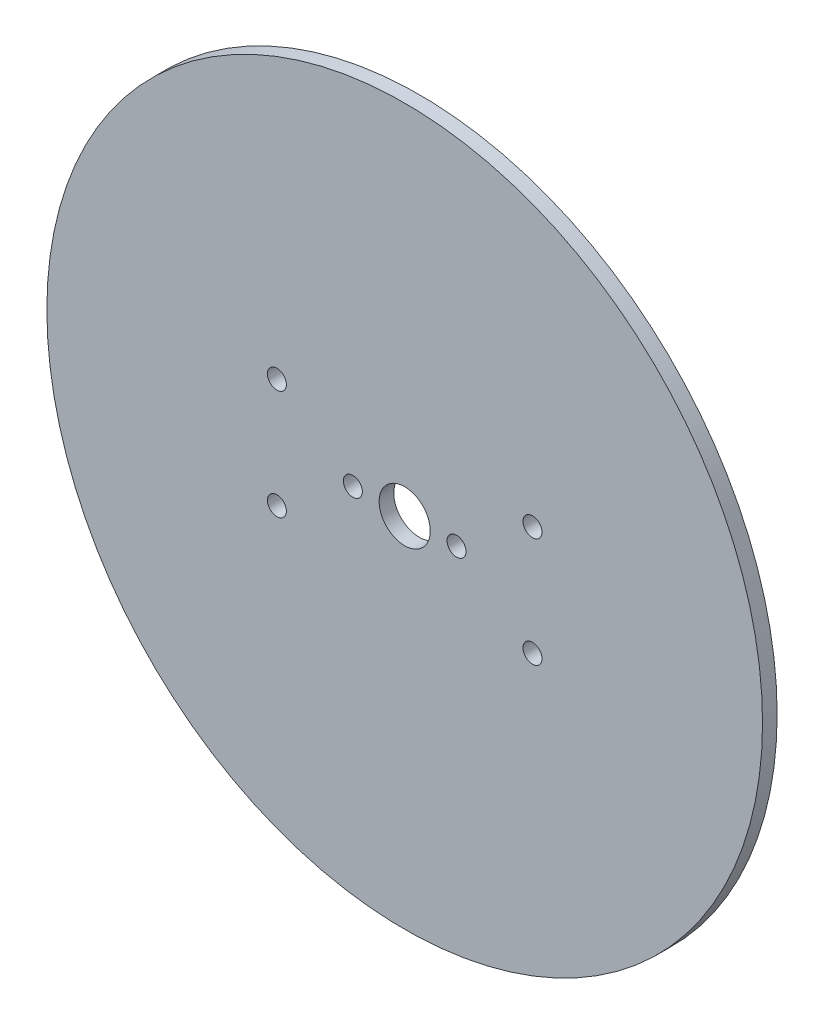
ISO-10303-21;
HEADER;
FILE_DESCRIPTION(('STEP AP214'),'2;1');
FILE_NAME('part.step','',(''),(''),'','','');
FILE_SCHEMA(('AUTOMOTIVE_DESIGN { 1 0 10303 214 1 1 1 1 }'));
ENDSEC;
DATA;
#1=APPLICATION_CONTEXT('core data for automotive mechanical design processes');
#2=APPLICATION_PROTOCOL_DEFINITION('international standard','automotive_design',2000,#1);
#3=PRODUCT_CONTEXT('',#1,'mechanical');
#4=PRODUCT('Part','Part','',(#3));
#5=PRODUCT_RELATED_PRODUCT_CATEGORY('part','',(#4));
#6=PRODUCT_DEFINITION_FORMATION('','',#4);
#7=PRODUCT_DEFINITION_CONTEXT('part definition',#1,'design');
#8=PRODUCT_DEFINITION('design','',#6,#7);
#9=PRODUCT_DEFINITION_SHAPE('','',#8);
#10=(LENGTH_UNIT() NAMED_UNIT(*) SI_UNIT(.MILLI.,.METRE.));
#11=(NAMED_UNIT(*) PLANE_ANGLE_UNIT() SI_UNIT($,.RADIAN.));
#12=(NAMED_UNIT(*) SI_UNIT($,.STERADIAN.) SOLID_ANGLE_UNIT());
#13=UNCERTAINTY_MEASURE_WITH_UNIT(LENGTH_MEASURE(1.E-05),#10,'distance_accuracy_value','');
#14=(GEOMETRIC_REPRESENTATION_CONTEXT(3) GLOBAL_UNCERTAINTY_ASSIGNED_CONTEXT((#13)) GLOBAL_UNIT_ASSIGNED_CONTEXT((#10,
#11,#12)) REPRESENTATION_CONTEXT('',''));
#15=CARTESIAN_POINT('',(0.,0.,0.));
#16=DIRECTION('',(0.,0.,1.));
#17=DIRECTION('',(1.,0.,0.));
#18=AXIS2_PLACEMENT_3D('',#15,#16,#17);
#19=CARTESIAN_POINT('',(0.,0.,2.));
#20=DIRECTION('',(0.,0.,-1.));
#21=DIRECTION('',(-1.,0.,0.));
#22=AXIS2_PLACEMENT_3D('',#19,#20,#21);
#23=CYLINDRICAL_SURFACE('',#22,49.);
#24=CARTESIAN_POINT('',(0.,0.,2.));
#25=DIRECTION('',(0.,0.,1.));
#26=DIRECTION('',(1.,0.,0.));
#27=AXIS2_PLACEMENT_3D('',#24,#25,#26);
#28=CIRCLE('',#27,49.);
#29=CARTESIAN_POINT('',(49.,0.,2.));
#30=VERTEX_POINT('',#29);
#31=EDGE_CURVE('E11',#30,#30,#28,.T.);
#32=ORIENTED_EDGE('',*,*,#31,.F.);
#33=EDGE_LOOP('',(#32));
#34=FACE_BOUND('',#33,.T.);
#35=CARTESIAN_POINT('',(0.,0.,0.));
#36=DIRECTION('',(0.,0.,1.));
#37=DIRECTION('',(1.,0.,0.));
#38=AXIS2_PLACEMENT_3D('',#35,#36,#37);
#39=CIRCLE('',#38,49.);
#40=CARTESIAN_POINT('',(49.,0.,0.));
#41=VERTEX_POINT('',#40);
#42=EDGE_CURVE('E49',#41,#41,#39,.T.);
#43=ORIENTED_EDGE('',*,*,#42,.T.);
#44=EDGE_LOOP('',(#43));
#45=FACE_BOUND('',#44,.T.);
#46=ADVANCED_FACE('F46',(#34,#45),#23,.T.);
#47=CARTESIAN_POINT('',(0.,0.,2.));
#48=DIRECTION('',(0.,0.,1.));
#49=DIRECTION('',(1.,0.,0.));
#50=AXIS2_PLACEMENT_3D('',#47,#48,#49);
#51=PLANE('',#50);
#52=CARTESIAN_POINT('',(-7.1,0.,2.));
#53=DIRECTION('',(0.,0.,1.));
#54=DIRECTION('',(1.,0.,0.));
#55=AXIS2_PLACEMENT_3D('',#52,#53,#54);
#56=CIRCLE('',#55,1.3);
#57=CARTESIAN_POINT('',(-5.8,0.,2.));
#58=VERTEX_POINT('',#57);
#59=EDGE_CURVE('E96',#58,#58,#56,.T.);
#60=ORIENTED_EDGE('',*,*,#59,.F.);
#61=EDGE_LOOP('',(#60));
#62=FACE_BOUND('',#61,.T.);
#63=CARTESIAN_POINT('',(7.1,0.,2.));
#64=DIRECTION('',(0.,0.,1.));
#65=DIRECTION('',(1.,0.,0.));
#66=AXIS2_PLACEMENT_3D('',#63,#64,#65);
#67=CIRCLE('',#66,1.3);
#68=CARTESIAN_POINT('',(8.4,0.,2.));
#69=VERTEX_POINT('',#68);
#70=EDGE_CURVE('E90',#69,#69,#67,.T.);
#71=ORIENTED_EDGE('',*,*,#70,.F.);
#72=EDGE_LOOP('',(#71));
#73=FACE_BOUND('',#72,.T.);
#74=CARTESIAN_POINT('',(-17.5,7.5,2.));
#75=DIRECTION('',(0.,0.,1.));
#76=DIRECTION('',(1.,0.,0.));
#77=AXIS2_PLACEMENT_3D('',#74,#75,#76);
#78=CIRCLE('',#77,1.3);
#79=CARTESIAN_POINT('',(-16.2,7.5,2.));
#80=VERTEX_POINT('',#79);
#81=EDGE_CURVE('E84',#80,#80,#78,.T.);
#82=ORIENTED_EDGE('',*,*,#81,.F.);
#83=EDGE_LOOP('',(#82));
#84=FACE_BOUND('',#83,.T.);
#85=CARTESIAN_POINT('',(-17.5,-7.5,2.));
#86=DIRECTION('',(0.,0.,1.));
#87=DIRECTION('',(1.,0.,0.));
#88=AXIS2_PLACEMENT_3D('',#85,#86,#87);
#89=CIRCLE('',#88,1.3);
#90=CARTESIAN_POINT('',(-16.2,-7.5,2.));
#91=VERTEX_POINT('',#90);
#92=EDGE_CURVE('E78',#91,#91,#89,.T.);
#93=ORIENTED_EDGE('',*,*,#92,.F.);
#94=EDGE_LOOP('',(#93));
#95=FACE_BOUND('',#94,.T.);
#96=CARTESIAN_POINT('',(17.5,-7.5,2.));
#97=DIRECTION('',(0.,0.,1.));
#98=DIRECTION('',(1.,0.,0.));
#99=AXIS2_PLACEMENT_3D('',#96,#97,#98);
#100=CIRCLE('',#99,1.3);
#101=CARTESIAN_POINT('',(18.8,-7.5,2.));
#102=VERTEX_POINT('',#101);
#103=EDGE_CURVE('E72',#102,#102,#100,.T.);
#104=ORIENTED_EDGE('',*,*,#103,.F.);
#105=EDGE_LOOP('',(#104));
#106=FACE_BOUND('',#105,.T.);
#107=CARTESIAN_POINT('',(17.5,7.5,2.));
#108=DIRECTION('',(0.,0.,1.));
#109=DIRECTION('',(1.,0.,0.));
#110=AXIS2_PLACEMENT_3D('',#107,#108,#109);
#111=CIRCLE('',#110,1.3);
#112=CARTESIAN_POINT('',(18.8,7.5,2.));
#113=VERTEX_POINT('',#112);
#114=EDGE_CURVE('E64',#113,#113,#111,.T.);
#115=ORIENTED_EDGE('',*,*,#114,.F.);
#116=EDGE_LOOP('',(#115));
#117=FACE_BOUND('',#116,.T.);
#118=CARTESIAN_POINT('',(0.,0.,2.));
#119=DIRECTION('',(0.,0.,1.));
#120=DIRECTION('',(1.,0.,0.));
#121=AXIS2_PLACEMENT_3D('',#118,#119,#120);
#122=CIRCLE('',#121,3.5);
#123=CARTESIAN_POINT('',(3.5,0.,2.));
#124=VERTEX_POINT('',#123);
#125=EDGE_CURVE('E61',#124,#124,#122,.F.);
#126=ORIENTED_EDGE('',*,*,#125,.T.);
#127=EDGE_LOOP('',(#126));
#128=FACE_BOUND('',#127,.T.);
#129=ORIENTED_EDGE('',*,*,#31,.T.);
#130=EDGE_LOOP('',(#129));
#131=FACE_BOUND('',#130,.T.);
#132=ADVANCED_FACE('F110',(#62,#73,#84,#95,#106,#117,#128,#131),#51,.T.);
#133=CARTESIAN_POINT('',(0.,0.,0.));
#134=DIRECTION('',(0.,0.,1.));
#135=DIRECTION('',(1.,0.,0.));
#136=AXIS2_PLACEMENT_3D('',#133,#134,#135);
#137=PLANE('',#136);
#138=CARTESIAN_POINT('',(-7.1,0.,0.));
#139=DIRECTION('',(0.,0.,-1.));
#140=DIRECTION('',(-1.,0.,0.));
#141=AXIS2_PLACEMENT_3D('',#138,#139,#140);
#142=CIRCLE('',#141,1.3);
#143=CARTESIAN_POINT('',(-8.4,0.,0.));
#144=VERTEX_POINT('',#143);
#145=EDGE_CURVE('E99',#144,#144,#142,.T.);
#146=ORIENTED_EDGE('',*,*,#145,.F.);
#147=EDGE_LOOP('',(#146));
#148=FACE_BOUND('',#147,.T.);
#149=CARTESIAN_POINT('',(7.1,0.,0.));
#150=DIRECTION('',(0.,0.,-1.));
#151=DIRECTION('',(-1.,0.,0.));
#152=AXIS2_PLACEMENT_3D('',#149,#150,#151);
#153=CIRCLE('',#152,1.3);
#154=CARTESIAN_POINT('',(5.8,0.,0.));
#155=VERTEX_POINT('',#154);
#156=EDGE_CURVE('E93',#155,#155,#153,.T.);
#157=ORIENTED_EDGE('',*,*,#156,.F.);
#158=EDGE_LOOP('',(#157));
#159=FACE_BOUND('',#158,.T.);
#160=CARTESIAN_POINT('',(-17.5,7.5,0.));
#161=DIRECTION('',(0.,0.,-1.));
#162=DIRECTION('',(-1.,0.,0.));
#163=AXIS2_PLACEMENT_3D('',#160,#161,#162);
#164=CIRCLE('',#163,1.3);
#165=CARTESIAN_POINT('',(-18.8,7.5,0.));
#166=VERTEX_POINT('',#165);
#167=EDGE_CURVE('E87',#166,#166,#164,.T.);
#168=ORIENTED_EDGE('',*,*,#167,.F.);
#169=EDGE_LOOP('',(#168));
#170=FACE_BOUND('',#169,.T.);
#171=CARTESIAN_POINT('',(-17.5,-7.5,0.));
#172=DIRECTION('',(0.,0.,-1.));
#173=DIRECTION('',(-1.,0.,0.));
#174=AXIS2_PLACEMENT_3D('',#171,#172,#173);
#175=CIRCLE('',#174,1.3);
#176=CARTESIAN_POINT('',(-18.8,-7.5,0.));
#177=VERTEX_POINT('',#176);
#178=EDGE_CURVE('E81',#177,#177,#175,.T.);
#179=ORIENTED_EDGE('',*,*,#178,.F.);
#180=EDGE_LOOP('',(#179));
#181=FACE_BOUND('',#180,.T.);
#182=CARTESIAN_POINT('',(17.5,-7.5,0.));
#183=DIRECTION('',(0.,0.,-1.));
#184=DIRECTION('',(-1.,0.,0.));
#185=AXIS2_PLACEMENT_3D('',#182,#183,#184);
#186=CIRCLE('',#185,1.3);
#187=CARTESIAN_POINT('',(16.2,-7.5,0.));
#188=VERTEX_POINT('',#187);
#189=EDGE_CURVE('E75',#188,#188,#186,.T.);
#190=ORIENTED_EDGE('',*,*,#189,.F.);
#191=EDGE_LOOP('',(#190));
#192=FACE_BOUND('',#191,.T.);
#193=CARTESIAN_POINT('',(17.5,7.5,0.));
#194=DIRECTION('',(0.,0.,-1.));
#195=DIRECTION('',(-1.,0.,0.));
#196=AXIS2_PLACEMENT_3D('',#193,#194,#195);
#197=CIRCLE('',#196,1.3);
#198=CARTESIAN_POINT('',(16.2,7.5,0.));
#199=VERTEX_POINT('',#198);
#200=EDGE_CURVE('E69',#199,#199,#197,.T.);
#201=ORIENTED_EDGE('',*,*,#200,.F.);
#202=EDGE_LOOP('',(#201));
#203=FACE_BOUND('',#202,.T.);
#204=CARTESIAN_POINT('',(0.,0.,0.));
#205=DIRECTION('',(0.,0.,-1.));
#206=DIRECTION('',(-1.,0.,0.));
#207=AXIS2_PLACEMENT_3D('',#204,#205,#206);
#208=CIRCLE('',#207,3.5);
#209=CARTESIAN_POINT('',(-3.5,0.,0.));
#210=VERTEX_POINT('',#209);
#211=EDGE_CURVE('E58',#210,#210,#208,.T.);
#212=ORIENTED_EDGE('',*,*,#211,.F.);
#213=EDGE_LOOP('',(#212));
#214=FACE_BOUND('',#213,.T.);
#215=ORIENTED_EDGE('',*,*,#42,.F.);
#216=EDGE_LOOP('',(#215));
#217=FACE_BOUND('',#216,.T.);
#218=ADVANCED_FACE('F106',(#148,#159,#170,#181,#192,#203,#214,#217),#137,.F.);
#219=CARTESIAN_POINT('',(0.,0.,2.001));
#220=DIRECTION('',(0.,0.,-1.));
#221=DIRECTION('',(-1.,0.,0.));
#222=AXIS2_PLACEMENT_3D('',#219,#220,#221);
#223=CYLINDRICAL_SURFACE('',#222,3.5);
#224=ORIENTED_EDGE('',*,*,#125,.F.);
#225=EDGE_LOOP('',(#224));
#226=FACE_BOUND('',#225,.T.);
#227=ORIENTED_EDGE('',*,*,#211,.T.);
#228=EDGE_LOOP('',(#227));
#229=FACE_BOUND('',#228,.T.);
#230=ADVANCED_FACE('F109',(#226,#229),#223,.F.);
#231=CARTESIAN_POINT('',(17.5,7.5,0.));
#232=DIRECTION('',(0.,0.,-1.));
#233=DIRECTION('',(-1.,0.,0.));
#234=AXIS2_PLACEMENT_3D('',#231,#232,#233);
#235=CYLINDRICAL_SURFACE('',#234,1.3);
#236=ORIENTED_EDGE('',*,*,#200,.T.);
#237=EDGE_LOOP('',(#236));
#238=FACE_BOUND('',#237,.T.);
#239=ORIENTED_EDGE('',*,*,#114,.T.);
#240=EDGE_LOOP('',(#239));
#241=FACE_BOUND('',#240,.T.);
#242=ADVANCED_FACE('F139',(#238,#241),#235,.F.);
#243=CARTESIAN_POINT('',(17.5,-7.5,0.));
#244=DIRECTION('',(0.,0.,-1.));
#245=DIRECTION('',(-1.,0.,0.));
#246=AXIS2_PLACEMENT_3D('',#243,#244,#245);
#247=CYLINDRICAL_SURFACE('',#246,1.3);
#248=ORIENTED_EDGE('',*,*,#189,.T.);
#249=EDGE_LOOP('',(#248));
#250=FACE_BOUND('',#249,.T.);
#251=ORIENTED_EDGE('',*,*,#103,.T.);
#252=EDGE_LOOP('',(#251));
#253=FACE_BOUND('',#252,.T.);
#254=ADVANCED_FACE('F143',(#250,#253),#247,.F.);
#255=CARTESIAN_POINT('',(-17.5,-7.5,0.));
#256=DIRECTION('',(0.,0.,-1.));
#257=DIRECTION('',(-1.,0.,0.));
#258=AXIS2_PLACEMENT_3D('',#255,#256,#257);
#259=CYLINDRICAL_SURFACE('',#258,1.3);
#260=ORIENTED_EDGE('',*,*,#178,.T.);
#261=EDGE_LOOP('',(#260));
#262=FACE_BOUND('',#261,.T.);
#263=ORIENTED_EDGE('',*,*,#92,.T.);
#264=EDGE_LOOP('',(#263));
#265=FACE_BOUND('',#264,.T.);
#266=ADVANCED_FACE('F147',(#262,#265),#259,.F.);
#267=CARTESIAN_POINT('',(-17.5,7.5,0.));
#268=DIRECTION('',(0.,0.,-1.));
#269=DIRECTION('',(-1.,0.,0.));
#270=AXIS2_PLACEMENT_3D('',#267,#268,#269);
#271=CYLINDRICAL_SURFACE('',#270,1.3);
#272=ORIENTED_EDGE('',*,*,#167,.T.);
#273=EDGE_LOOP('',(#272));
#274=FACE_BOUND('',#273,.T.);
#275=ORIENTED_EDGE('',*,*,#81,.T.);
#276=EDGE_LOOP('',(#275));
#277=FACE_BOUND('',#276,.T.);
#278=ADVANCED_FACE('F151',(#274,#277),#271,.F.);
#279=CARTESIAN_POINT('',(7.1,0.,0.));
#280=DIRECTION('',(0.,0.,-1.));
#281=DIRECTION('',(-1.,0.,0.));
#282=AXIS2_PLACEMENT_3D('',#279,#280,#281);
#283=CYLINDRICAL_SURFACE('',#282,1.3);
#284=ORIENTED_EDGE('',*,*,#156,.T.);
#285=EDGE_LOOP('',(#284));
#286=FACE_BOUND('',#285,.T.);
#287=ORIENTED_EDGE('',*,*,#70,.T.);
#288=EDGE_LOOP('',(#287));
#289=FACE_BOUND('',#288,.T.);
#290=ADVANCED_FACE('F155',(#286,#289),#283,.F.);
#291=CARTESIAN_POINT('',(-7.1,0.,0.));
#292=DIRECTION('',(0.,0.,-1.));
#293=DIRECTION('',(-1.,0.,0.));
#294=AXIS2_PLACEMENT_3D('',#291,#292,#293);
#295=CYLINDRICAL_SURFACE('',#294,1.3);
#296=ORIENTED_EDGE('',*,*,#145,.T.);
#297=EDGE_LOOP('',(#296));
#298=FACE_BOUND('',#297,.T.);
#299=ORIENTED_EDGE('',*,*,#59,.T.);
#300=EDGE_LOOP('',(#299));
#301=FACE_BOUND('',#300,.T.);
#302=ADVANCED_FACE('F103',(#298,#301),#295,.F.);
#303=CLOSED_SHELL('',(#46,#132,#218,#230,#242,#254,#266,#278,#290,#302));
#304=MANIFOLD_SOLID_BREP('B2',#303);
#305=ADVANCED_BREP_SHAPE_REPRESENTATION('',(#18,#304),#14);
#306=SHAPE_DEFINITION_REPRESENTATION(#9,#305);
ENDSEC;
END-ISO-10303-21;
